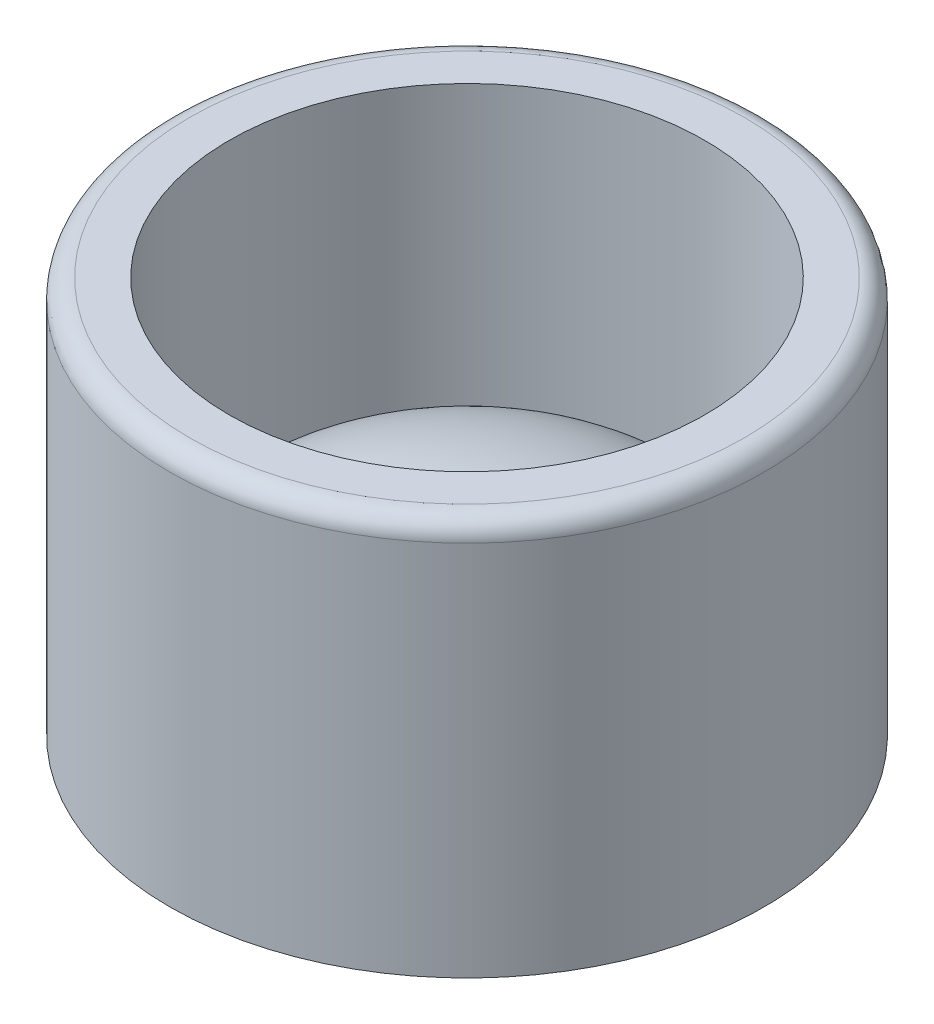
ISO-10303-21;
HEADER;
FILE_DESCRIPTION(('STEP AP214'),'2;1');
FILE_NAME('part.step','',(''),(''),'','','');
FILE_SCHEMA(('AUTOMOTIVE_DESIGN { 1 0 10303 214 1 1 1 1 }'));
ENDSEC;
DATA;
#1=APPLICATION_CONTEXT('core data for automotive mechanical design processes');
#2=APPLICATION_PROTOCOL_DEFINITION('international standard','automotive_design',2000,#1);
#3=PRODUCT_CONTEXT('',#1,'mechanical');
#4=PRODUCT('Part','Part','',(#3));
#5=PRODUCT_RELATED_PRODUCT_CATEGORY('part','',(#4));
#6=PRODUCT_DEFINITION_FORMATION('','',#4);
#7=PRODUCT_DEFINITION_CONTEXT('part definition',#1,'design');
#8=PRODUCT_DEFINITION('design','',#6,#7);
#9=PRODUCT_DEFINITION_SHAPE('','',#8);
#10=(LENGTH_UNIT() NAMED_UNIT(*) SI_UNIT(.MILLI.,.METRE.));
#11=(NAMED_UNIT(*) PLANE_ANGLE_UNIT() SI_UNIT($,.RADIAN.));
#12=(NAMED_UNIT(*) SI_UNIT($,.STERADIAN.) SOLID_ANGLE_UNIT());
#13=UNCERTAINTY_MEASURE_WITH_UNIT(LENGTH_MEASURE(1.E-05),#10,'distance_accuracy_value','');
#14=(GEOMETRIC_REPRESENTATION_CONTEXT(3) GLOBAL_UNCERTAINTY_ASSIGNED_CONTEXT((#13)) GLOBAL_UNIT_ASSIGNED_CONTEXT((#10,
#11,#12)) REPRESENTATION_CONTEXT('',''));
#15=CARTESIAN_POINT('',(0.,0.,0.));
#16=DIRECTION('',(0.,0.,1.));
#17=DIRECTION('',(1.,0.,0.));
#18=AXIS2_PLACEMENT_3D('',#15,#16,#17);
#19=CARTESIAN_POINT('',(0.,10.,0.));
#20=DIRECTION('',(0.,-1.,0.));
#21=DIRECTION('',(0.,0.,-1.));
#22=AXIS2_PLACEMENT_3D('',#19,#20,#21);
#23=CYLINDRICAL_SURFACE('',#22,7.5);
#24=CARTESIAN_POINT('',(0.,9.5,0.));
#25=DIRECTION('',(0.,1.,0.));
#26=DIRECTION('',(0.,0.,1.));
#27=AXIS2_PLACEMENT_3D('',#24,#25,#26);
#28=CIRCLE('',#27,7.5);
#29=CARTESIAN_POINT('',(0.,9.5,7.5));
#30=VERTEX_POINT('',#29);
#31=EDGE_CURVE('E11',#30,#30,#28,.F.);
#32=ORIENTED_EDGE('',*,*,#31,.T.);
#33=EDGE_LOOP('',(#32));
#34=FACE_BOUND('',#33,.T.);
#35=CARTESIAN_POINT('',(0.,0.,0.));
#36=DIRECTION('',(0.,1.,0.));
#37=DIRECTION('',(0.,0.,1.));
#38=AXIS2_PLACEMENT_3D('',#35,#36,#37);
#39=CIRCLE('',#38,7.5);
#40=CARTESIAN_POINT('',(0.,0.,7.5));
#41=VERTEX_POINT('',#40);
#42=EDGE_CURVE('E50',#41,#41,#39,.T.);
#43=ORIENTED_EDGE('',*,*,#42,.T.);
#44=EDGE_LOOP('',(#43));
#45=FACE_BOUND('',#44,.T.);
#46=ADVANCED_FACE('F32',(#34,#45),#23,.T.);
#47=CARTESIAN_POINT('',(0.,10.,0.));
#48=DIRECTION('',(0.,1.,0.));
#49=DIRECTION('',(0.,0.,1.));
#50=AXIS2_PLACEMENT_3D('',#47,#48,#49);
#51=PLANE('',#50);
#52=CARTESIAN_POINT('',(0.,10.,0.));
#53=DIRECTION('',(0.,1.,0.));
#54=DIRECTION('',(0.,0.,1.));
#55=AXIS2_PLACEMENT_3D('',#52,#53,#54);
#56=CIRCLE('',#55,7.);
#57=CARTESIAN_POINT('',(0.,10.,7.));
#58=VERTEX_POINT('',#57);
#59=EDGE_CURVE('E39',#58,#58,#56,.T.);
#60=ORIENTED_EDGE('',*,*,#59,.T.);
#61=EDGE_LOOP('',(#60));
#62=FACE_BOUND('',#61,.T.);
#63=CARTESIAN_POINT('',(0.,10.,0.));
#64=DIRECTION('',(0.,1.,0.));
#65=DIRECTION('',(0.,0.,1.));
#66=AXIS2_PLACEMENT_3D('',#63,#64,#65);
#67=CIRCLE('',#66,6.);
#68=CARTESIAN_POINT('',(0.,10.,6.));
#69=VERTEX_POINT('',#68);
#70=EDGE_CURVE('E51',#69,#69,#67,.T.);
#71=ORIENTED_EDGE('',*,*,#70,.F.);
#72=EDGE_LOOP('',(#71));
#73=FACE_BOUND('',#72,.T.);
#74=ADVANCED_FACE('F62',(#62,#73),#51,.T.);
#75=CARTESIAN_POINT('',(0.,0.,0.));
#76=DIRECTION('',(0.,1.,0.));
#77=DIRECTION('',(0.,0.,1.));
#78=AXIS2_PLACEMENT_3D('',#75,#76,#77);
#79=PLANE('',#78);
#80=ORIENTED_EDGE('',*,*,#42,.F.);
#81=EDGE_LOOP('',(#80));
#82=FACE_BOUND('',#81,.T.);
#83=ADVANCED_FACE('F64',(#82),#79,.F.);
#84=CARTESIAN_POINT('',(0.,2.,0.));
#85=DIRECTION('',(0.,1.,0.));
#86=DIRECTION('',(0.,0.,1.));
#87=AXIS2_PLACEMENT_3D('',#84,#85,#86);
#88=CYLINDRICAL_SURFACE('',#87,6.);
#89=CARTESIAN_POINT('',(0.,2.,0.));
#90=DIRECTION('',(0.,1.,0.));
#91=DIRECTION('',(0.,0.,1.));
#92=AXIS2_PLACEMENT_3D('',#89,#90,#91);
#93=CIRCLE('',#92,6.);
#94=CARTESIAN_POINT('',(0.,2.,6.));
#95=VERTEX_POINT('',#94);
#96=EDGE_CURVE('E48',#95,#95,#93,.T.);
#97=ORIENTED_EDGE('',*,*,#96,.F.);
#98=EDGE_LOOP('',(#97));
#99=FACE_BOUND('',#98,.T.);
#100=ORIENTED_EDGE('',*,*,#70,.T.);
#101=EDGE_LOOP('',(#100));
#102=FACE_BOUND('',#101,.T.);
#103=ADVANCED_FACE('F45',(#99,#102),#88,.F.);
#104=CARTESIAN_POINT('',(0.,2.,0.));
#105=DIRECTION('',(1.,0.,0.));
#106=DIRECTION('',(0.,0.,1.));
#107=AXIS2_PLACEMENT_3D('',#104,#105,#106);
#108=ELLIPSE('',#107,6.,3.);
#109=TRIMMED_CURVE('',#108,(PARAMETER_VALUE(4.71238898038469)),
(PARAMETER_VALUE(7.85398163397448)),.T.,.PARAMETER.);
#110=CARTESIAN_POINT('',(0.,-1.,0.));
#111=DIRECTION('',(0.,1.,0.));
#112=AXIS1_PLACEMENT('',#110,#111);
#113=SURFACE_OF_REVOLUTION('',#109,#112);
#114=CARTESIAN_POINT('',(0.,5.,0.));
#115=VERTEX_POINT('',#114);
#116=VERTEX_LOOP('',#115);
#117=FACE_BOUND('',#116,.T.);
#118=ORIENTED_EDGE('',*,*,#96,.T.);
#119=EDGE_LOOP('',(#118));
#120=FACE_BOUND('',#119,.T.);
#121=ADVANCED_FACE('F42',(#117,#120),#113,.F.);
#122=CARTESIAN_POINT('',(0.,9.5,0.));
#123=DIRECTION('',(0.,1.,0.));
#124=DIRECTION('',(0.,0.,1.));
#125=AXIS2_PLACEMENT_3D('',#122,#123,#124);
#126=TOROIDAL_SURFACE('',#125,7.,0.5);
#127=ORIENTED_EDGE('',*,*,#31,.F.);
#128=EDGE_LOOP('',(#127));
#129=FACE_BOUND('',#128,.T.);
#130=ORIENTED_EDGE('',*,*,#59,.F.);
#131=EDGE_LOOP('',(#130));
#132=FACE_BOUND('',#131,.T.);
#133=ADVANCED_FACE('F34',(#129,#132),#126,.T.);
#134=CLOSED_SHELL('',(#46,#74,#83,#103,#121,#133));
#135=MANIFOLD_SOLID_BREP('B2',#134);
#136=ADVANCED_BREP_SHAPE_REPRESENTATION('',(#18,#135),#14);
#137=SHAPE_DEFINITION_REPRESENTATION(#9,#136);
ENDSEC;
END-ISO-10303-21;
